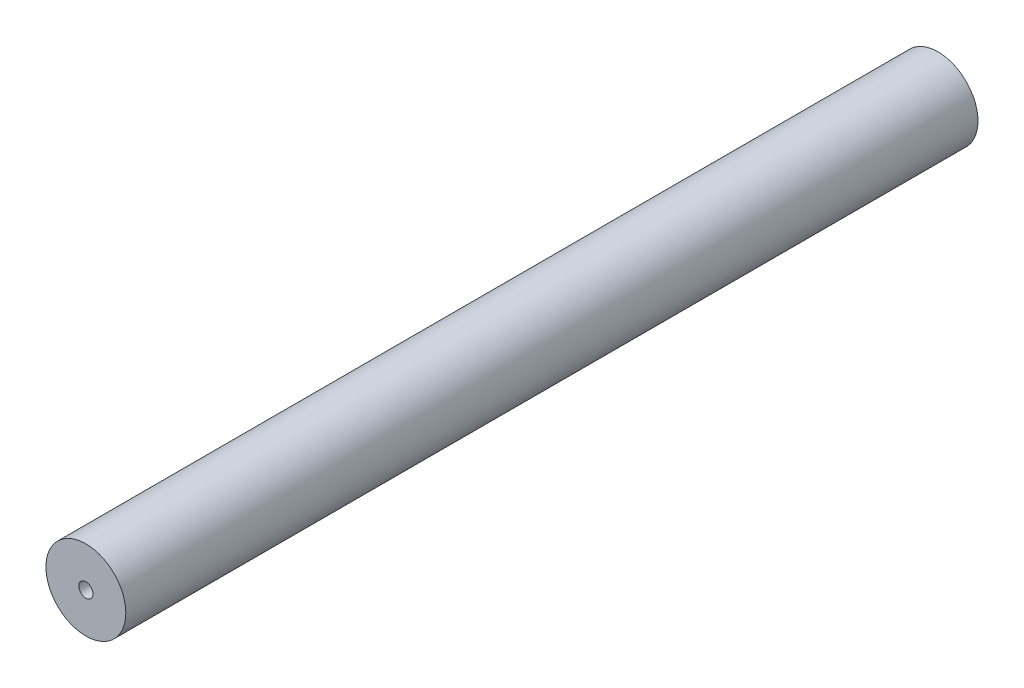
ISO-10303-21;
HEADER;
FILE_DESCRIPTION(('STEP AP214'),'2;1');
FILE_NAME('part.step','',(''),(''),'','','');
FILE_SCHEMA(('AUTOMOTIVE_DESIGN { 1 0 10303 214 1 1 1 1 }'));
ENDSEC;
DATA;
#1=APPLICATION_CONTEXT('core data for automotive mechanical design processes');
#2=APPLICATION_PROTOCOL_DEFINITION('international standard','automotive_design',2000,#1);
#3=PRODUCT_CONTEXT('',#1,'mechanical');
#4=PRODUCT('Part','Part','',(#3));
#5=PRODUCT_RELATED_PRODUCT_CATEGORY('part','',(#4));
#6=PRODUCT_DEFINITION_FORMATION('','',#4);
#7=PRODUCT_DEFINITION_CONTEXT('part definition',#1,'design');
#8=PRODUCT_DEFINITION('design','',#6,#7);
#9=PRODUCT_DEFINITION_SHAPE('','',#8);
#10=(LENGTH_UNIT() NAMED_UNIT(*) SI_UNIT(.MILLI.,.METRE.));
#11=(NAMED_UNIT(*) PLANE_ANGLE_UNIT() SI_UNIT($,.RADIAN.));
#12=(NAMED_UNIT(*) SI_UNIT($,.STERADIAN.) SOLID_ANGLE_UNIT());
#13=UNCERTAINTY_MEASURE_WITH_UNIT(LENGTH_MEASURE(1.E-05),#10,'distance_accuracy_value','');
#14=(GEOMETRIC_REPRESENTATION_CONTEXT(3) GLOBAL_UNCERTAINTY_ASSIGNED_CONTEXT((#13)) GLOBAL_UNIT_ASSIGNED_CONTEXT((#10,
#11,#12)) REPRESENTATION_CONTEXT('',''));
#15=CARTESIAN_POINT('',(0.,0.,0.));
#16=DIRECTION('',(0.,0.,1.));
#17=DIRECTION('',(1.,0.,0.));
#18=AXIS2_PLACEMENT_3D('',#15,#16,#17);
#19=CARTESIAN_POINT('',(0.,0.,48.));
#20=DIRECTION('',(0.,0.,1.));
#21=DIRECTION('',(1.,0.,0.));
#22=AXIS2_PLACEMENT_3D('',#19,#20,#21);
#23=PLANE('',#22);
#24=CARTESIAN_POINT('',(0.,0.,48.));
#25=DIRECTION('',(0.,0.,1.));
#26=DIRECTION('',(1.,0.,0.));
#27=AXIS2_PLACEMENT_3D('',#24,#25,#26);
#28=CIRCLE('',#27,2.25);
#29=CARTESIAN_POINT('',(2.25,0.,48.));
#30=VERTEX_POINT('',#29);
#31=EDGE_CURVE('E10',#30,#30,#28,.T.);
#32=ORIENTED_EDGE('',*,*,#31,.T.);
#33=EDGE_LOOP('',(#32));
#34=FACE_BOUND('',#33,.T.);
#35=CARTESIAN_POINT('',(0.,0.,48.));
#36=DIRECTION('',(0.,0.,1.));
#37=DIRECTION('',(1.,0.,0.));
#38=AXIS2_PLACEMENT_3D('',#35,#36,#37);
#39=CIRCLE('',#38,0.4);
#40=CARTESIAN_POINT('',(0.4,0.,48.));
#41=VERTEX_POINT('',#40);
#42=EDGE_CURVE('E46',#41,#41,#39,.T.);
#43=ORIENTED_EDGE('',*,*,#42,.F.);
#44=EDGE_LOOP('',(#43));
#45=FACE_BOUND('',#44,.T.);
#46=ADVANCED_FACE('F35',(#34,#45),#23,.T.);
#47=CARTESIAN_POINT('',(0.,0.,0.));
#48=DIRECTION('',(0.,0.,1.));
#49=DIRECTION('',(1.,0.,0.));
#50=AXIS2_PLACEMENT_3D('',#47,#48,#49);
#51=PLANE('',#50);
#52=CARTESIAN_POINT('',(0.,0.,0.));
#53=DIRECTION('',(0.,0.,1.));
#54=DIRECTION('',(1.,0.,0.));
#55=AXIS2_PLACEMENT_3D('',#52,#53,#54);
#56=CIRCLE('',#55,2.25);
#57=CARTESIAN_POINT('',(2.25,0.,0.));
#58=VERTEX_POINT('',#57);
#59=EDGE_CURVE('E39',#58,#58,#56,.T.);
#60=ORIENTED_EDGE('',*,*,#59,.F.);
#61=EDGE_LOOP('',(#60));
#62=FACE_BOUND('',#61,.T.);
#63=CARTESIAN_POINT('',(0.,0.,0.));
#64=DIRECTION('',(0.,0.,1.));
#65=DIRECTION('',(1.,0.,0.));
#66=AXIS2_PLACEMENT_3D('',#63,#64,#65);
#67=CIRCLE('',#66,0.4);
#68=CARTESIAN_POINT('',(0.4,0.,0.));
#69=VERTEX_POINT('',#68);
#70=EDGE_CURVE('E48',#69,#69,#67,.T.);
#71=ORIENTED_EDGE('',*,*,#70,.T.);
#72=EDGE_LOOP('',(#71));
#73=FACE_BOUND('',#72,.T.);
#74=ADVANCED_FACE('F58',(#62,#73),#51,.F.);
#75=CARTESIAN_POINT('',(0.,0.,48.));
#76=DIRECTION('',(0.,0.,-1.));
#77=DIRECTION('',(-1.,0.,0.));
#78=AXIS2_PLACEMENT_3D('',#75,#76,#77);
#79=CYLINDRICAL_SURFACE('',#78,2.25);
#80=ORIENTED_EDGE('',*,*,#31,.F.);
#81=EDGE_LOOP('',(#80));
#82=FACE_BOUND('',#81,.T.);
#83=ORIENTED_EDGE('',*,*,#59,.T.);
#84=EDGE_LOOP('',(#83));
#85=FACE_BOUND('',#84,.T.);
#86=ADVANCED_FACE('F37',(#82,#85),#79,.T.);
#87=CARTESIAN_POINT('',(0.,0.,48.));
#88=DIRECTION('',(0.,0.,-1.));
#89=DIRECTION('',(-1.,0.,0.));
#90=AXIS2_PLACEMENT_3D('',#87,#88,#89);
#91=CYLINDRICAL_SURFACE('',#90,0.4);
#92=ORIENTED_EDGE('',*,*,#42,.T.);
#93=EDGE_LOOP('',(#92));
#94=FACE_BOUND('',#93,.T.);
#95=ORIENTED_EDGE('',*,*,#70,.F.);
#96=EDGE_LOOP('',(#95));
#97=FACE_BOUND('',#96,.T.);
#98=ADVANCED_FACE('F54',(#94,#97),#91,.F.);
#99=CLOSED_SHELL('',(#46,#74,#86,#98));
#100=MANIFOLD_SOLID_BREP('B2',#99);
#101=ADVANCED_BREP_SHAPE_REPRESENTATION('',(#18,#100),#14);
#102=SHAPE_DEFINITION_REPRESENTATION(#9,#101);
ENDSEC;
END-ISO-10303-21;
